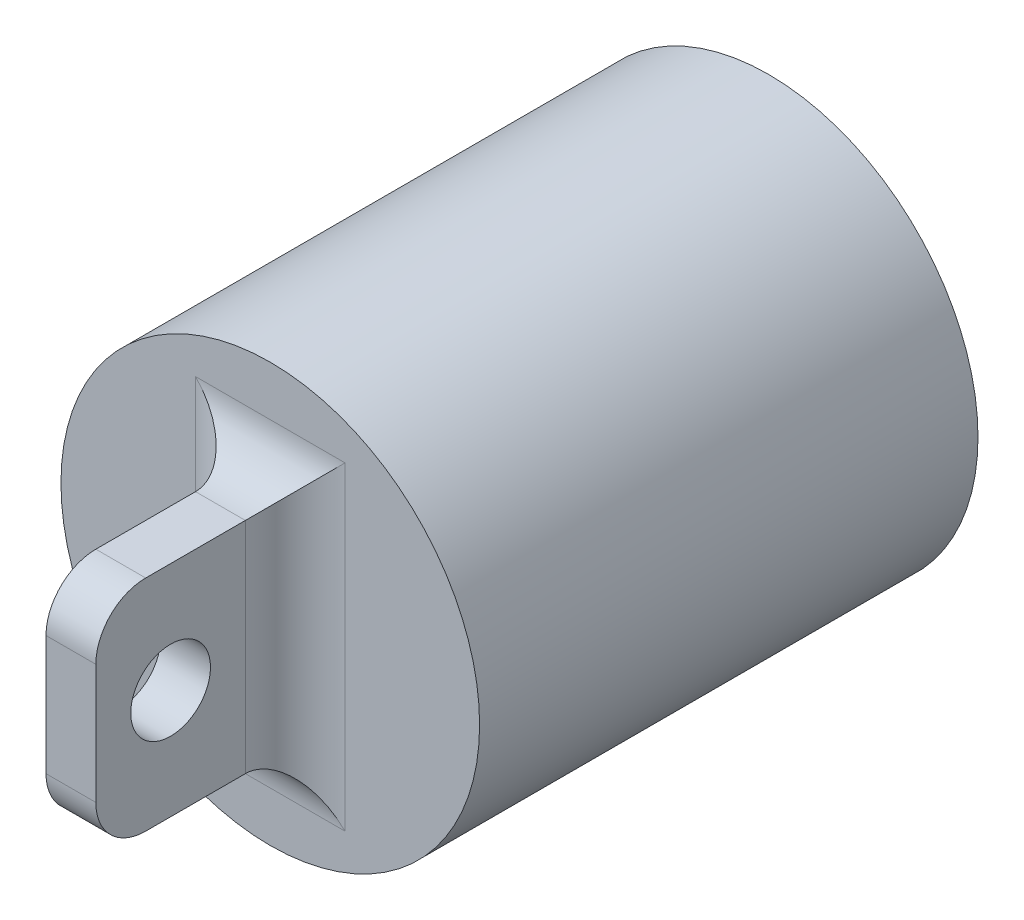
ISO-10303-21;
HEADER;
FILE_DESCRIPTION(('STEP AP214'),'2;1');
FILE_NAME('part.step','',(''),(''),'','','');
FILE_SCHEMA(('AUTOMOTIVE_DESIGN { 1 0 10303 214 1 1 1 1 }'));
ENDSEC;
DATA;
#1=APPLICATION_CONTEXT('core data for automotive mechanical design processes');
#2=APPLICATION_PROTOCOL_DEFINITION('international standard','automotive_design',2000,#1);
#3=PRODUCT_CONTEXT('',#1,'mechanical');
#4=PRODUCT('Part','Part','',(#3));
#5=PRODUCT_RELATED_PRODUCT_CATEGORY('part','',(#4));
#6=PRODUCT_DEFINITION_FORMATION('','',#4);
#7=PRODUCT_DEFINITION_CONTEXT('part definition',#1,'design');
#8=PRODUCT_DEFINITION('design','',#6,#7);
#9=PRODUCT_DEFINITION_SHAPE('','',#8);
#10=(LENGTH_UNIT() NAMED_UNIT(*) SI_UNIT(.MILLI.,.METRE.));
#11=(NAMED_UNIT(*) PLANE_ANGLE_UNIT() SI_UNIT($,.RADIAN.));
#12=(NAMED_UNIT(*) SI_UNIT($,.STERADIAN.) SOLID_ANGLE_UNIT());
#13=UNCERTAINTY_MEASURE_WITH_UNIT(LENGTH_MEASURE(1.E-05),#10,'distance_accuracy_value','');
#14=(GEOMETRIC_REPRESENTATION_CONTEXT(3) GLOBAL_UNCERTAINTY_ASSIGNED_CONTEXT((#13)) GLOBAL_UNIT_ASSIGNED_CONTEXT((#10,
#11,#12)) REPRESENTATION_CONTEXT('',''));
#15=CARTESIAN_POINT('',(0.,0.,0.));
#16=DIRECTION('',(0.,0.,1.));
#17=DIRECTION('',(1.,0.,0.));
#18=AXIS2_PLACEMENT_3D('',#15,#16,#17);
#19=CARTESIAN_POINT('',(0.,0.,50.));
#20=DIRECTION('',(0.,0.,1.));
#21=DIRECTION('',(1.,0.,0.));
#22=AXIS2_PLACEMENT_3D('',#19,#20,#21);
#23=PLANE('',#22);
#24=DIRECTION('',(0.,1.,0.));
#25=VECTOR('',#24,1.);
#26=CARTESIAN_POINT('',(7.5,0.,50.));
#27=LINE('',#26,#25);
#28=CARTESIAN_POINT('',(7.5,16.,50.));
#29=VERTEX_POINT('',#28);
#30=CARTESIAN_POINT('',(7.5,-16.,50.));
#31=VERTEX_POINT('',#30);
#32=EDGE_CURVE('E126',#29,#31,#27,.F.);
#33=ORIENTED_EDGE('',*,*,#32,.T.);
#34=DIRECTION('',(-1.,0.,0.));
#35=VECTOR('',#34,1.);
#36=CARTESIAN_POINT('',(0.,-16.,50.));
#37=LINE('',#36,#35);
#38=CARTESIAN_POINT('',(-7.5,-16.,50.));
#39=VERTEX_POINT('',#38);
#40=EDGE_CURVE('E107',#31,#39,#37,.T.);
#41=ORIENTED_EDGE('',*,*,#40,.T.);
#42=DIRECTION('',(0.,1.,0.));
#43=VECTOR('',#42,1.);
#44=CARTESIAN_POINT('',(-7.5,11.,50.));
#45=LINE('',#44,#43);
#46=CARTESIAN_POINT('',(-7.5,16.,50.));
#47=VERTEX_POINT('',#46);
#48=EDGE_CURVE('E115',#39,#47,#45,.T.);
#49=ORIENTED_EDGE('',*,*,#48,.T.);
#50=DIRECTION('',(-1.,0.,0.));
#51=VECTOR('',#50,1.);
#52=CARTESIAN_POINT('',(0.,16.,50.));
#53=LINE('',#52,#51);
#54=EDGE_CURVE('E121',#47,#29,#53,.F.);
#55=ORIENTED_EDGE('',*,*,#54,.T.);
#56=EDGE_LOOP('',(#33,#41,#49,#55));
#57=FACE_BOUND('',#56,.T.);
#58=CARTESIAN_POINT('',(0.,0.,50.));
#59=DIRECTION('',(0.,0.,1.));
#60=DIRECTION('',(1.,0.,0.));
#61=AXIS2_PLACEMENT_3D('',#58,#59,#60);
#62=CIRCLE('',#61,21.);
#63=CARTESIAN_POINT('',(21.,0.,50.));
#64=VERTEX_POINT('',#63);
#65=EDGE_CURVE('E122',#64,#64,#62,.T.);
#66=ORIENTED_EDGE('',*,*,#65,.T.);
#67=EDGE_LOOP('',(#66));
#68=FACE_BOUND('',#67,.T.);
#69=ADVANCED_FACE('F32',(#57,#68),#23,.T.);
#70=CARTESIAN_POINT('',(0.,0.,50.));
#71=DIRECTION('',(0.,0.,-1.));
#72=DIRECTION('',(-1.,0.,0.));
#73=AXIS2_PLACEMENT_3D('',#70,#71,#72);
#74=CYLINDRICAL_SURFACE('',#73,21.);
#75=ORIENTED_EDGE('',*,*,#65,.F.);
#76=EDGE_LOOP('',(#75));
#77=FACE_BOUND('',#76,.T.);
#78=CARTESIAN_POINT('',(0.,0.,0.));
#79=DIRECTION('',(0.,0.,1.));
#80=DIRECTION('',(1.,0.,0.));
#81=AXIS2_PLACEMENT_3D('',#78,#79,#80);
#82=CIRCLE('',#81,21.);
#83=CARTESIAN_POINT('',(21.,0.,0.));
#84=VERTEX_POINT('',#83);
#85=EDGE_CURVE('E186',#84,#84,#82,.T.);
#86=ORIENTED_EDGE('',*,*,#85,.T.);
#87=EDGE_LOOP('',(#86));
#88=FACE_BOUND('',#87,.T.);
#89=ADVANCED_FACE('F208',(#77,#88),#74,.T.);
#90=CARTESIAN_POINT('',(0.,0.,0.));
#91=DIRECTION('',(0.,0.,1.));
#92=DIRECTION('',(1.,0.,0.));
#93=AXIS2_PLACEMENT_3D('',#90,#91,#92);
#94=PLANE('',#93);
#95=ORIENTED_EDGE('',*,*,#85,.F.);
#96=EDGE_LOOP('',(#95));
#97=FACE_BOUND('',#96,.T.);
#98=ADVANCED_FACE('F213',(#97),#94,.F.);
#99=CARTESIAN_POINT('',(2.5,11.,50.));
#100=DIRECTION('',(0.,-1.,0.));
#101=DIRECTION('',(0.,0.,-1.));
#102=AXIS2_PLACEMENT_3D('',#99,#100,#101);
#103=PLANE('',#102);
#104=DIRECTION('',(0.,0.,1.));
#105=VECTOR('',#104,1.);
#106=CARTESIAN_POINT('',(-2.5,11.,50.));
#107=LINE('',#106,#105);
#108=CARTESIAN_POINT('',(-2.5,11.,55.));
#109=VERTEX_POINT('',#108);
#110=CARTESIAN_POINT('',(-2.5,11.,65.));
#111=VERTEX_POINT('',#110);
#112=EDGE_CURVE('E146',#109,#111,#107,.T.);
#113=ORIENTED_EDGE('',*,*,#112,.T.);
#114=DIRECTION('',(-1.,0.,0.));
#115=VECTOR('',#114,1.);
#116=CARTESIAN_POINT('',(2.5,11.,65.));
#117=LINE('',#116,#115);
#118=CARTESIAN_POINT('',(2.5,11.,65.));
#119=VERTEX_POINT('',#118);
#120=EDGE_CURVE('E56',#111,#119,#117,.F.);
#121=ORIENTED_EDGE('',*,*,#120,.T.);
#122=DIRECTION('',(0.,0.,1.));
#123=VECTOR('',#122,1.);
#124=CARTESIAN_POINT('',(2.5,11.,50.));
#125=LINE('',#124,#123);
#126=CARTESIAN_POINT('',(2.5,11.,55.));
#127=VERTEX_POINT('',#126);
#128=EDGE_CURVE('E161',#127,#119,#125,.T.);
#129=ORIENTED_EDGE('',*,*,#128,.F.);
#130=DIRECTION('',(-1.,0.,0.));
#131=VECTOR('',#130,1.);
#132=CARTESIAN_POINT('',(2.5,11.,55.));
#133=LINE('',#132,#131);
#134=EDGE_CURVE('E135',#127,#109,#133,.T.);
#135=ORIENTED_EDGE('',*,*,#134,.T.);
#136=EDGE_LOOP('',(#113,#121,#129,#135));
#137=FACE_BOUND('',#136,.T.);
#138=ADVANCED_FACE('F176',(#137),#103,.F.);
#139=CARTESIAN_POINT('',(2.5,11.,70.));
#140=DIRECTION('',(0.,0.,-1.));
#141=DIRECTION('',(-1.,0.,0.));
#142=AXIS2_PLACEMENT_3D('',#139,#140,#141);
#143=PLANE('',#142);
#144=DIRECTION('',(0.,-1.,0.));
#145=VECTOR('',#144,1.);
#146=CARTESIAN_POINT('',(2.5,11.,70.));
#147=LINE('',#146,#145);
#148=CARTESIAN_POINT('',(2.5,6.,70.));
#149=VERTEX_POINT('',#148);
#150=CARTESIAN_POINT('',(2.5,-6.,70.));
#151=VERTEX_POINT('',#150);
#152=EDGE_CURVE('E160',#149,#151,#147,.T.);
#153=ORIENTED_EDGE('',*,*,#152,.F.);
#154=DIRECTION('',(-1.,0.,0.));
#155=VECTOR('',#154,1.);
#156=CARTESIAN_POINT('',(2.5,6.,70.));
#157=LINE('',#156,#155);
#158=CARTESIAN_POINT('',(-2.5,6.,70.));
#159=VERTEX_POINT('',#158);
#160=EDGE_CURVE('E148',#149,#159,#157,.T.);
#161=ORIENTED_EDGE('',*,*,#160,.T.);
#162=DIRECTION('',(0.,-1.,0.));
#163=VECTOR('',#162,1.);
#164=CARTESIAN_POINT('',(-2.5,11.,70.));
#165=LINE('',#164,#163);
#166=CARTESIAN_POINT('',(-2.5,-6.,70.));
#167=VERTEX_POINT('',#166);
#168=EDGE_CURVE('E175',#159,#167,#165,.T.);
#169=ORIENTED_EDGE('',*,*,#168,.T.);
#170=DIRECTION('',(-1.,0.,0.));
#171=VECTOR('',#170,1.);
#172=CARTESIAN_POINT('',(2.5,-6.,70.));
#173=LINE('',#172,#171);
#174=EDGE_CURVE('E139',#167,#151,#173,.F.);
#175=ORIENTED_EDGE('',*,*,#174,.T.);
#176=EDGE_LOOP('',(#153,#161,#169,#175));
#177=FACE_BOUND('',#176,.T.);
#178=ADVANCED_FACE('F165',(#177),#143,.F.);
#179=CARTESIAN_POINT('',(2.5,-11.,50.));
#180=DIRECTION('',(0.,1.,0.));
#181=DIRECTION('',(0.,0.,1.));
#182=AXIS2_PLACEMENT_3D('',#179,#180,#181);
#183=PLANE('',#182);
#184=DIRECTION('',(0.,0.,-1.));
#185=VECTOR('',#184,1.);
#186=CARTESIAN_POINT('',(2.5,-11.,50.));
#187=LINE('',#186,#185);
#188=CARTESIAN_POINT('',(2.5,-11.,65.));
#189=VERTEX_POINT('',#188);
#190=CARTESIAN_POINT('',(2.5,-11.,55.));
#191=VERTEX_POINT('',#190);
#192=EDGE_CURVE('E169',#189,#191,#187,.T.);
#193=ORIENTED_EDGE('',*,*,#192,.F.);
#194=DIRECTION('',(-1.,0.,0.));
#195=VECTOR('',#194,1.);
#196=CARTESIAN_POINT('',(2.5,-11.,65.));
#197=LINE('',#196,#195);
#198=CARTESIAN_POINT('',(-2.5,-11.,65.));
#199=VERTEX_POINT('',#198);
#200=EDGE_CURVE('E11',#189,#199,#197,.T.);
#201=ORIENTED_EDGE('',*,*,#200,.T.);
#202=DIRECTION('',(0.,0.,-1.));
#203=VECTOR('',#202,1.);
#204=CARTESIAN_POINT('',(-2.5,-11.,50.));
#205=LINE('',#204,#203);
#206=CARTESIAN_POINT('',(-2.5,-11.,55.));
#207=VERTEX_POINT('',#206);
#208=EDGE_CURVE('E179',#199,#207,#205,.T.);
#209=ORIENTED_EDGE('',*,*,#208,.T.);
#210=DIRECTION('',(-1.,0.,0.));
#211=VECTOR('',#210,1.);
#212=CARTESIAN_POINT('',(2.5,-11.,55.));
#213=LINE('',#212,#211);
#214=EDGE_CURVE('E109',#207,#191,#213,.F.);
#215=ORIENTED_EDGE('',*,*,#214,.T.);
#216=EDGE_LOOP('',(#193,#201,#209,#215));
#217=FACE_BOUND('',#216,.T.);
#218=ADVANCED_FACE('F195',(#217),#183,.F.);
#219=CARTESIAN_POINT('',(2.5,0.,0.));
#220=DIRECTION('',(-1.,0.,0.));
#221=DIRECTION('',(0.,0.,1.));
#222=AXIS2_PLACEMENT_3D('',#219,#220,#221);
#223=PLANE('',#222);
#224=CARTESIAN_POINT('',(2.5,0.,62.5));
#225=DIRECTION('',(1.,0.,0.));
#226=DIRECTION('',(0.,0.,-1.));
#227=AXIS2_PLACEMENT_3D('',#224,#225,#226);
#228=CIRCLE('',#227,4.00000000000001);
#229=CARTESIAN_POINT('',(2.5,0.,58.5));
#230=VERTEX_POINT('',#229);
#231=EDGE_CURVE('E327',#230,#230,#228,.T.);
#232=ORIENTED_EDGE('',*,*,#231,.F.);
#233=EDGE_LOOP('',(#232));
#234=FACE_BOUND('',#233,.T.);
#235=ORIENTED_EDGE('',*,*,#128,.T.);
#236=CARTESIAN_POINT('',(2.5,6.,65.));
#237=DIRECTION('',(-1.,0.,0.));
#238=DIRECTION('',(0.,0.,1.));
#239=AXIS2_PLACEMENT_3D('',#236,#237,#238);
#240=CIRCLE('',#239,5.);
#241=EDGE_CURVE('E41',#119,#149,#240,.F.);
#242=ORIENTED_EDGE('',*,*,#241,.T.);
#243=ORIENTED_EDGE('',*,*,#152,.T.);
#244=CARTESIAN_POINT('',(2.5,-6.,65.));
#245=DIRECTION('',(-1.,0.,0.));
#246=DIRECTION('',(0.,0.,1.));
#247=AXIS2_PLACEMENT_3D('',#244,#245,#246);
#248=CIRCLE('',#247,5.);
#249=EDGE_CURVE('E48',#151,#189,#248,.F.);
#250=ORIENTED_EDGE('',*,*,#249,.T.);
#251=ORIENTED_EDGE('',*,*,#192,.T.);
#252=DIRECTION('',(0.,1.,0.));
#253=VECTOR('',#252,1.);
#254=CARTESIAN_POINT('',(2.5,0.,55.));
#255=LINE('',#254,#253);
#256=EDGE_CURVE('E129',#191,#127,#255,.T.);
#257=ORIENTED_EDGE('',*,*,#256,.T.);
#258=EDGE_LOOP('',(#235,#242,#243,#250,#251,#257));
#259=FACE_BOUND('',#258,.T.);
#260=ADVANCED_FACE('F159',(#234,#259),#223,.F.);
#261=CARTESIAN_POINT('',(-2.5,0.,0.));
#262=DIRECTION('',(-1.,0.,0.));
#263=DIRECTION('',(0.,0.,1.));
#264=AXIS2_PLACEMENT_3D('',#261,#262,#263);
#265=PLANE('',#264);
#266=CARTESIAN_POINT('',(-2.5,0.,62.5));
#267=DIRECTION('',(-1.,0.,0.));
#268=DIRECTION('',(0.,0.,1.));
#269=AXIS2_PLACEMENT_3D('',#266,#267,#268);
#270=CIRCLE('',#269,4.00000000000001);
#271=CARTESIAN_POINT('',(-2.5,0.,66.5));
#272=VERTEX_POINT('',#271);
#273=EDGE_CURVE('E36',#272,#272,#270,.T.);
#274=ORIENTED_EDGE('',*,*,#273,.F.);
#275=EDGE_LOOP('',(#274));
#276=FACE_BOUND('',#275,.T.);
#277=ORIENTED_EDGE('',*,*,#168,.F.);
#278=CARTESIAN_POINT('',(-2.5,6.,65.));
#279=DIRECTION('',(-1.,0.,0.));
#280=DIRECTION('',(0.,0.,1.));
#281=AXIS2_PLACEMENT_3D('',#278,#279,#280);
#282=CIRCLE('',#281,5.);
#283=EDGE_CURVE('E153',#159,#111,#282,.T.);
#284=ORIENTED_EDGE('',*,*,#283,.T.);
#285=ORIENTED_EDGE('',*,*,#112,.F.);
#286=DIRECTION('',(0.,1.,0.));
#287=VECTOR('',#286,1.);
#288=CARTESIAN_POINT('',(-2.5,-11.,55.));
#289=LINE('',#288,#287);
#290=EDGE_CURVE('E137',#109,#207,#289,.F.);
#291=ORIENTED_EDGE('',*,*,#290,.T.);
#292=ORIENTED_EDGE('',*,*,#208,.F.);
#293=CARTESIAN_POINT('',(-2.5,-6.,65.));
#294=DIRECTION('',(-1.,0.,0.));
#295=DIRECTION('',(0.,0.,1.));
#296=AXIS2_PLACEMENT_3D('',#293,#294,#295);
#297=CIRCLE('',#296,5.);
#298=EDGE_CURVE('E151',#199,#167,#297,.T.);
#299=ORIENTED_EDGE('',*,*,#298,.T.);
#300=EDGE_LOOP('',(#277,#284,#285,#291,#292,#299));
#301=FACE_BOUND('',#300,.T.);
#302=ADVANCED_FACE('F174',(#276,#301),#265,.T.);
#303=CARTESIAN_POINT('',(2.5,16.,55.));
#304=DIRECTION('',(-1.,0.,0.));
#305=DIRECTION('',(0.,0.,1.));
#306=AXIS2_PLACEMENT_3D('',#303,#304,#305);
#307=CYLINDRICAL_SURFACE('',#306,5.);
#308=CARTESIAN_POINT('',(-7.5,16.,55.));
#309=DIRECTION('',(-0.707106781186547,-0.707106781186547,0.));
#310=DIRECTION('',(0.707106781186547,-0.707106781186547,0.));
#311=AXIS2_PLACEMENT_3D('',#308,#309,#310);
#312=ELLIPSE('',#311,7.07106781186547,5.);
#313=EDGE_CURVE('E118',#109,#47,#312,.F.);
#314=ORIENTED_EDGE('',*,*,#313,.F.);
#315=ORIENTED_EDGE('',*,*,#134,.F.);
#316=CARTESIAN_POINT('',(7.5,16.,55.));
#317=DIRECTION('',(-0.707106781186547,0.707106781186547,0.));
#318=DIRECTION('',(-0.707106781186547,-0.707106781186547,0.));
#319=AXIS2_PLACEMENT_3D('',#316,#317,#318);
#320=ELLIPSE('',#319,7.07106781186547,5.);
#321=EDGE_CURVE('E143',#29,#127,#320,.T.);
#322=ORIENTED_EDGE('',*,*,#321,.F.);
#323=ORIENTED_EDGE('',*,*,#54,.F.);
#324=EDGE_LOOP('',(#314,#315,#322,#323));
#325=FACE_BOUND('',#324,.T.);
#326=ADVANCED_FACE('F190',(#325),#307,.F.);
#327=CARTESIAN_POINT('',(7.5,0.,55.));
#328=DIRECTION('',(0.,1.,0.));
#329=DIRECTION('',(0.,0.,1.));
#330=AXIS2_PLACEMENT_3D('',#327,#328,#329);
#331=CYLINDRICAL_SURFACE('',#330,5.);
#332=ORIENTED_EDGE('',*,*,#321,.T.);
#333=ORIENTED_EDGE('',*,*,#256,.F.);
#334=CARTESIAN_POINT('',(7.5,-16.,55.));
#335=DIRECTION('',(0.707106781186547,0.707106781186547,0.));
#336=DIRECTION('',(-0.707106781186547,0.707106781186547,0.));
#337=AXIS2_PLACEMENT_3D('',#334,#335,#336);
#338=ELLIPSE('',#337,7.07106781186547,5.);
#339=EDGE_CURVE('E112',#31,#191,#338,.T.);
#340=ORIENTED_EDGE('',*,*,#339,.F.);
#341=ORIENTED_EDGE('',*,*,#32,.F.);
#342=EDGE_LOOP('',(#332,#333,#340,#341));
#343=FACE_BOUND('',#342,.T.);
#344=ADVANCED_FACE('F193',(#343),#331,.F.);
#345=CARTESIAN_POINT('',(-7.5,0.,55.));
#346=DIRECTION('',(0.,-1.,0.));
#347=DIRECTION('',(0.,0.,-1.));
#348=AXIS2_PLACEMENT_3D('',#345,#346,#347);
#349=CYLINDRICAL_SURFACE('',#348,5.);
#350=ORIENTED_EDGE('',*,*,#313,.T.);
#351=ORIENTED_EDGE('',*,*,#48,.F.);
#352=CARTESIAN_POINT('',(-7.5,-16.,55.));
#353=DIRECTION('',(0.707106781186547,-0.707106781186547,0.));
#354=DIRECTION('',(-0.707106781186547,-0.707106781186547,0.));
#355=AXIS2_PLACEMENT_3D('',#352,#353,#354);
#356=ELLIPSE('',#355,7.07106781186547,5.);
#357=EDGE_CURVE('E102',#207,#39,#356,.F.);
#358=ORIENTED_EDGE('',*,*,#357,.F.);
#359=ORIENTED_EDGE('',*,*,#290,.F.);
#360=EDGE_LOOP('',(#350,#351,#358,#359));
#361=FACE_BOUND('',#360,.T.);
#362=ADVANCED_FACE('F116',(#361),#349,.F.);
#363=CARTESIAN_POINT('',(0.,-16.,55.));
#364=DIRECTION('',(-1.,0.,0.));
#365=DIRECTION('',(0.,0.,1.));
#366=AXIS2_PLACEMENT_3D('',#363,#364,#365);
#367=CYLINDRICAL_SURFACE('',#366,5.);
#368=ORIENTED_EDGE('',*,*,#339,.T.);
#369=ORIENTED_EDGE('',*,*,#214,.F.);
#370=ORIENTED_EDGE('',*,*,#357,.T.);
#371=ORIENTED_EDGE('',*,*,#40,.F.);
#372=EDGE_LOOP('',(#368,#369,#370,#371));
#373=FACE_BOUND('',#372,.T.);
#374=ADVANCED_FACE('F105',(#373),#367,.F.);
#375=CARTESIAN_POINT('',(2.5,6.,65.));
#376=DIRECTION('',(-1.,0.,0.));
#377=DIRECTION('',(0.,0.,1.));
#378=AXIS2_PLACEMENT_3D('',#375,#376,#377);
#379=CYLINDRICAL_SURFACE('',#378,5.);
#380=ORIENTED_EDGE('',*,*,#241,.F.);
#381=ORIENTED_EDGE('',*,*,#120,.F.);
#382=ORIENTED_EDGE('',*,*,#283,.F.);
#383=ORIENTED_EDGE('',*,*,#160,.F.);
#384=EDGE_LOOP('',(#380,#381,#382,#383));
#385=FACE_BOUND('',#384,.T.);
#386=ADVANCED_FACE('F171',(#385),#379,.T.);
#387=CARTESIAN_POINT('',(2.5,-6.,65.));
#388=DIRECTION('',(-1.,0.,0.));
#389=DIRECTION('',(0.,0.,1.));
#390=AXIS2_PLACEMENT_3D('',#387,#388,#389);
#391=CYLINDRICAL_SURFACE('',#390,5.);
#392=ORIENTED_EDGE('',*,*,#249,.F.);
#393=ORIENTED_EDGE('',*,*,#174,.F.);
#394=ORIENTED_EDGE('',*,*,#298,.F.);
#395=ORIENTED_EDGE('',*,*,#200,.F.);
#396=EDGE_LOOP('',(#392,#393,#394,#395));
#397=FACE_BOUND('',#396,.T.);
#398=ADVANCED_FACE('F34',(#397),#391,.T.);
#399=CARTESIAN_POINT('',(-21.,0.,62.5));
#400=DIRECTION('',(1.,0.,0.));
#401=DIRECTION('',(0.,0.,-1.));
#402=AXIS2_PLACEMENT_3D('',#399,#400,#401);
#403=CYLINDRICAL_SURFACE('',#402,4.00000000000001);
#404=ORIENTED_EDGE('',*,*,#273,.T.);
#405=EDGE_LOOP('',(#404));
#406=FACE_BOUND('',#405,.T.);
#407=ORIENTED_EDGE('',*,*,#231,.T.);
#408=EDGE_LOOP('',(#407));
#409=FACE_BOUND('',#408,.T.);
#410=ADVANCED_FACE('F200',(#406,#409),#403,.F.);
#411=CLOSED_SHELL('',(#69,#89,#98,#138,#178,#218,#260,#302,#326,#344,#362,#374,#386,#398,#410));
#412=MANIFOLD_SOLID_BREP('B2',#411);
#413=ADVANCED_BREP_SHAPE_REPRESENTATION('',(#18,#412),#14);
#414=SHAPE_DEFINITION_REPRESENTATION(#9,#413);
ENDSEC;
END-ISO-10303-21;
